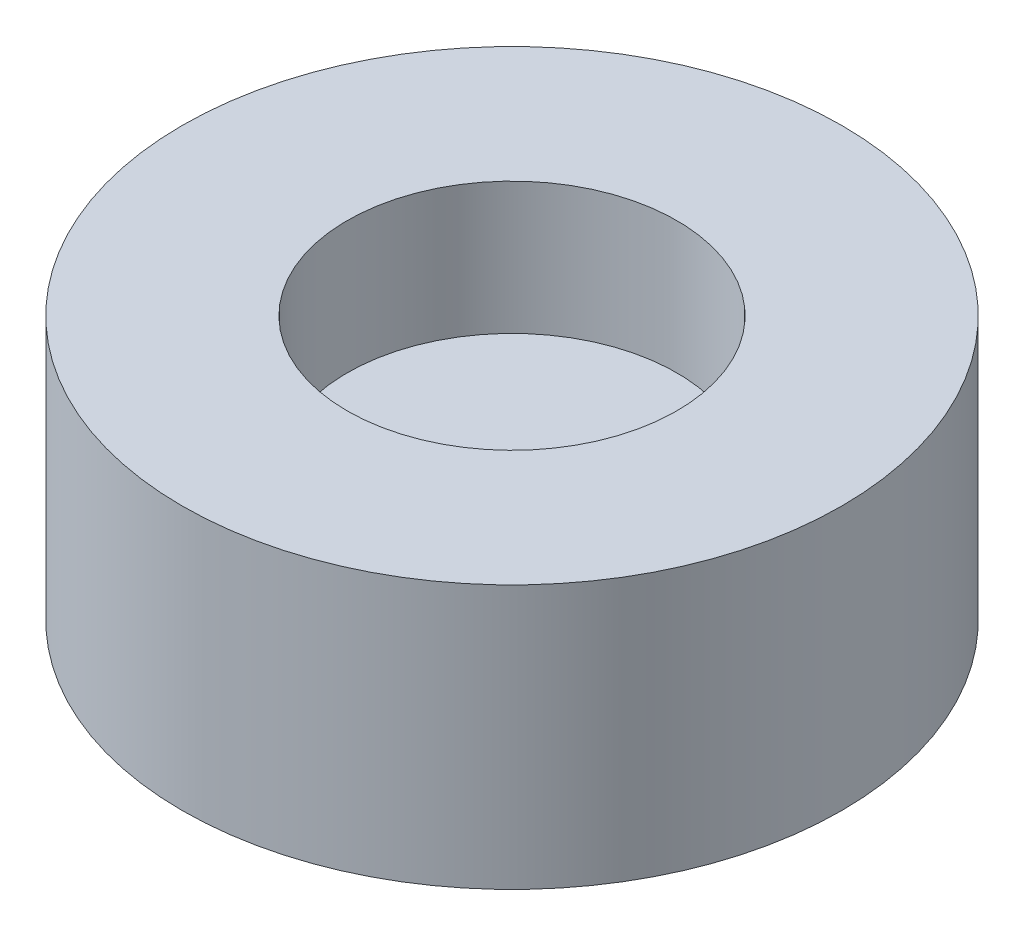
ISO-10303-21;
HEADER;
FILE_DESCRIPTION(('STEP AP214'),'2;1');
FILE_NAME('part.step','',(''),(''),'','','');
FILE_SCHEMA(('AUTOMOTIVE_DESIGN { 1 0 10303 214 1 1 1 1 }'));
ENDSEC;
DATA;
#1=APPLICATION_CONTEXT('core data for automotive mechanical design processes');
#2=APPLICATION_PROTOCOL_DEFINITION('international standard','automotive_design',2000,#1);
#3=PRODUCT_CONTEXT('',#1,'mechanical');
#4=PRODUCT('Part','Part','',(#3));
#5=PRODUCT_RELATED_PRODUCT_CATEGORY('part','',(#4));
#6=PRODUCT_DEFINITION_FORMATION('','',#4);
#7=PRODUCT_DEFINITION_CONTEXT('part definition',#1,'design');
#8=PRODUCT_DEFINITION('design','',#6,#7);
#9=PRODUCT_DEFINITION_SHAPE('','',#8);
#10=(LENGTH_UNIT() NAMED_UNIT(*) SI_UNIT(.MILLI.,.METRE.));
#11=(NAMED_UNIT(*) PLANE_ANGLE_UNIT() SI_UNIT($,.RADIAN.));
#12=(NAMED_UNIT(*) SI_UNIT($,.STERADIAN.) SOLID_ANGLE_UNIT());
#13=UNCERTAINTY_MEASURE_WITH_UNIT(LENGTH_MEASURE(1.E-05),#10,'distance_accuracy_value','');
#14=(GEOMETRIC_REPRESENTATION_CONTEXT(3) GLOBAL_UNCERTAINTY_ASSIGNED_CONTEXT((#13)) GLOBAL_UNIT_ASSIGNED_CONTEXT((#10,
#11,#12)) REPRESENTATION_CONTEXT('',''));
#15=CARTESIAN_POINT('',(0.,0.,0.));
#16=DIRECTION('',(0.,0.,1.));
#17=DIRECTION('',(1.,0.,0.));
#18=AXIS2_PLACEMENT_3D('',#15,#16,#17);
#19=CARTESIAN_POINT('',(0.,4.,0.));
#20=DIRECTION('',(0.,-1.,0.));
#21=DIRECTION('',(0.,0.,-1.));
#22=AXIS2_PLACEMENT_3D('',#19,#20,#21);
#23=CYLINDRICAL_SURFACE('',#22,5.);
#24=CARTESIAN_POINT('',(0.,4.,0.));
#25=DIRECTION('',(0.,1.,0.));
#26=DIRECTION('',(0.,0.,1.));
#27=AXIS2_PLACEMENT_3D('',#24,#25,#26);
#28=CIRCLE('',#27,5.);
#29=CARTESIAN_POINT('',(0.,4.,5.));
#30=VERTEX_POINT('',#29);
#31=EDGE_CURVE('E10',#30,#30,#28,.T.);
#32=ORIENTED_EDGE('',*,*,#31,.F.);
#33=EDGE_LOOP('',(#32));
#34=FACE_BOUND('',#33,.T.);
#35=CARTESIAN_POINT('',(0.,0.,0.));
#36=DIRECTION('',(0.,1.,0.));
#37=DIRECTION('',(0.,0.,1.));
#38=AXIS2_PLACEMENT_3D('',#35,#36,#37);
#39=CIRCLE('',#38,5.);
#40=CARTESIAN_POINT('',(0.,0.,5.));
#41=VERTEX_POINT('',#40);
#42=EDGE_CURVE('E38',#41,#41,#39,.T.);
#43=ORIENTED_EDGE('',*,*,#42,.T.);
#44=EDGE_LOOP('',(#43));
#45=FACE_BOUND('',#44,.T.);
#46=ADVANCED_FACE('F35',(#34,#45),#23,.T.);
#47=CARTESIAN_POINT('',(0.,4.,0.));
#48=DIRECTION('',(0.,1.,0.));
#49=DIRECTION('',(0.,0.,1.));
#50=AXIS2_PLACEMENT_3D('',#47,#48,#49);
#51=PLANE('',#50);
#52=CARTESIAN_POINT('',(0.,4.,0.));
#53=DIRECTION('',(0.,1.,0.));
#54=DIRECTION('',(0.,0.,1.));
#55=AXIS2_PLACEMENT_3D('',#52,#53,#54);
#56=CIRCLE('',#55,2.5);
#57=CARTESIAN_POINT('',(0.,4.,2.5));
#58=VERTEX_POINT('',#57);
#59=EDGE_CURVE('E49',#58,#58,#56,.T.);
#60=ORIENTED_EDGE('',*,*,#59,.F.);
#61=EDGE_LOOP('',(#60));
#62=FACE_BOUND('',#61,.T.);
#63=ORIENTED_EDGE('',*,*,#31,.T.);
#64=EDGE_LOOP('',(#63));
#65=FACE_BOUND('',#64,.T.);
#66=ADVANCED_FACE('F66',(#62,#65),#51,.T.);
#67=CARTESIAN_POINT('',(0.,0.,0.));
#68=DIRECTION('',(0.,1.,0.));
#69=DIRECTION('',(0.,0.,1.));
#70=AXIS2_PLACEMENT_3D('',#67,#68,#69);
#71=PLANE('',#70);
#72=ORIENTED_EDGE('',*,*,#42,.F.);
#73=EDGE_LOOP('',(#72));
#74=FACE_BOUND('',#73,.T.);
#75=ADVANCED_FACE('F62',(#74),#71,.F.);
#76=CARTESIAN_POINT('',(0.,2.,0.));
#77=DIRECTION('',(0.,1.,0.));
#78=DIRECTION('',(0.,0.,1.));
#79=AXIS2_PLACEMENT_3D('',#76,#77,#78);
#80=CYLINDRICAL_SURFACE('',#79,2.5);
#81=CARTESIAN_POINT('',(0.,2.,0.));
#82=DIRECTION('',(0.,1.,0.));
#83=DIRECTION('',(0.,0.,1.));
#84=AXIS2_PLACEMENT_3D('',#81,#82,#83);
#85=CIRCLE('',#84,2.5);
#86=CARTESIAN_POINT('',(0.,2.,2.5));
#87=VERTEX_POINT('',#86);
#88=EDGE_CURVE('E47',#87,#87,#85,.T.);
#89=ORIENTED_EDGE('',*,*,#88,.F.);
#90=EDGE_LOOP('',(#89));
#91=FACE_BOUND('',#90,.T.);
#92=ORIENTED_EDGE('',*,*,#59,.T.);
#93=EDGE_LOOP('',(#92));
#94=FACE_BOUND('',#93,.T.);
#95=ADVANCED_FACE('F59',(#91,#94),#80,.F.);
#96=CARTESIAN_POINT('',(0.,2.,0.));
#97=DIRECTION('',(0.,1.,0.));
#98=DIRECTION('',(0.,0.,1.));
#99=AXIS2_PLACEMENT_3D('',#96,#97,#98);
#100=PLANE('',#99);
#101=ORIENTED_EDGE('',*,*,#88,.T.);
#102=EDGE_LOOP('',(#101));
#103=FACE_BOUND('',#102,.T.);
#104=ADVANCED_FACE('F57',(#103),#100,.T.);
#105=CLOSED_SHELL('',(#46,#66,#75,#95,#104));
#106=MANIFOLD_SOLID_BREP('B2',#105);
#107=ADVANCED_BREP_SHAPE_REPRESENTATION('',(#18,#106),#14);
#108=SHAPE_DEFINITION_REPRESENTATION(#9,#107);
ENDSEC;
END-ISO-10303-21;
